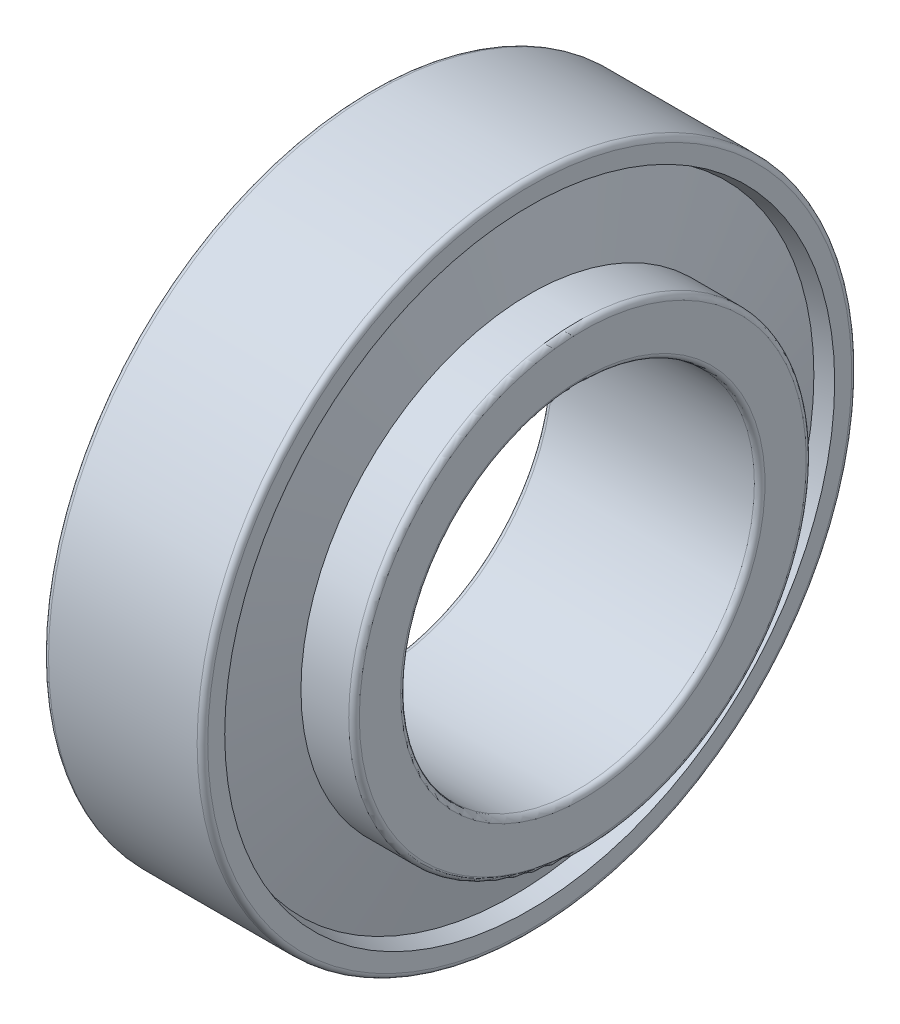
ISO-10303-21;
HEADER;
FILE_DESCRIPTION(('STEP AP214'),'2;1');
FILE_NAME('part.step','',(''),(''),'','','');
FILE_SCHEMA(('AUTOMOTIVE_DESIGN { 1 0 10303 214 1 1 1 1 }'));
ENDSEC;
DATA;
#1=APPLICATION_CONTEXT('core data for automotive mechanical design processes');
#2=APPLICATION_PROTOCOL_DEFINITION('international standard','automotive_design',2000,#1);
#3=PRODUCT_CONTEXT('',#1,'mechanical');
#4=PRODUCT('Part','Part','',(#3));
#5=PRODUCT_RELATED_PRODUCT_CATEGORY('part','',(#4));
#6=PRODUCT_DEFINITION_FORMATION('','',#4);
#7=PRODUCT_DEFINITION_CONTEXT('part definition',#1,'design');
#8=PRODUCT_DEFINITION('design','',#6,#7);
#9=PRODUCT_DEFINITION_SHAPE('','',#8);
#10=(LENGTH_UNIT() NAMED_UNIT(*) SI_UNIT(.MILLI.,.METRE.));
#11=(NAMED_UNIT(*) PLANE_ANGLE_UNIT() SI_UNIT($,.RADIAN.));
#12=(NAMED_UNIT(*) SI_UNIT($,.STERADIAN.) SOLID_ANGLE_UNIT());
#13=UNCERTAINTY_MEASURE_WITH_UNIT(LENGTH_MEASURE(1.E-05),#10,'distance_accuracy_value','');
#14=(GEOMETRIC_REPRESENTATION_CONTEXT(3) GLOBAL_UNCERTAINTY_ASSIGNED_CONTEXT((#13)) GLOBAL_UNIT_ASSIGNED_CONTEXT((#10,
#11,#12)) REPRESENTATION_CONTEXT('',''));
#15=CARTESIAN_POINT('',(0.,0.,0.));
#16=DIRECTION('',(0.,0.,1.));
#17=DIRECTION('',(1.,0.,0.));
#18=AXIS2_PLACEMENT_3D('',#15,#16,#17);
#19=CARTESIAN_POINT('',(0.755685063646205,0.,0.));
#20=DIRECTION('',(-1.,0.,0.));
#21=DIRECTION('',(0.,0.,1.));
#22=AXIS2_PLACEMENT_3D('',#19,#20,#21);
#23=CONICAL_SURFACE('',#22,15.0145140042686,1.36135681655557);
#24=CARTESIAN_POINT('',(1.51137012729241,0.,0.));
#25=DIRECTION('',(-1.,0.,0.));
#26=DIRECTION('',(0.,0.,1.));
#27=AXIS2_PLACEMENT_3D('',#24,#25,#26);
#28=CIRCLE('',#27,11.4592953005556);
#29=CARTESIAN_POINT('',(1.51137012729241,0.,11.4592953005556));
#30=VERTEX_POINT('',#29);
#31=EDGE_CURVE('E112',#30,#30,#28,.T.);
#32=ORIENTED_EDGE('',*,*,#31,.F.);
#33=EDGE_LOOP('',(#32));
#34=FACE_BOUND('',#33,.T.);
#35=CARTESIAN_POINT('',(0.755685063646205,0.,0.));
#36=DIRECTION('',(-1.,0.,0.));
#37=DIRECTION('',(0.,0.,1.));
#38=AXIS2_PLACEMENT_3D('',#35,#36,#37);
#39=CIRCLE('',#38,15.0145140042686);
#40=CARTESIAN_POINT('',(0.755685063646205,0.,15.0145140042686));
#41=VERTEX_POINT('',#40);
#42=EDGE_CURVE('E10',#41,#41,#39,.T.);
#43=ORIENTED_EDGE('',*,*,#42,.T.);
#44=EDGE_LOOP('',(#43));
#45=FACE_BOUND('',#44,.T.);
#46=ADVANCED_FACE('F37',(#34,#45),#23,.F.);
#47=CARTESIAN_POINT('',(0.,0.,0.));
#48=DIRECTION('',(1.,0.,0.));
#49=DIRECTION('',(0.,0.,-1.));
#50=AXIS2_PLACEMENT_3D('',#47,#48,#49);
#51=CONICAL_SURFACE('',#50,14.8105,0.263685978861176);
#52=ORIENTED_EDGE('',*,*,#42,.F.);
#53=EDGE_LOOP('',(#52));
#54=FACE_BOUND('',#53,.T.);
#55=CARTESIAN_POINT('',(0.,0.,0.));
#56=DIRECTION('',(-1.,0.,0.));
#57=DIRECTION('',(0.,0.,1.));
#58=AXIS2_PLACEMENT_3D('',#55,#56,#57);
#59=CIRCLE('',#58,14.8105);
#60=CARTESIAN_POINT('',(0.,0.,14.8105));
#61=VERTEX_POINT('',#60);
#62=EDGE_CURVE('E44',#61,#61,#59,.T.);
#63=ORIENTED_EDGE('',*,*,#62,.T.);
#64=EDGE_LOOP('',(#63));
#65=FACE_BOUND('',#64,.T.);
#66=ADVANCED_FACE('F120',(#54,#65),#51,.F.);
#67=CARTESIAN_POINT('',(0.,14.8105,0.));
#68=DIRECTION('',(1.,0.,0.));
#69=DIRECTION('',(0.,0.,-1.));
#70=AXIS2_PLACEMENT_3D('',#67,#68,#69);
#71=PLANE('',#70);
#72=ORIENTED_EDGE('',*,*,#62,.F.);
#73=EDGE_LOOP('',(#72));
#74=FACE_BOUND('',#73,.T.);
#75=CARTESIAN_POINT('',(0.,0.,0.));
#76=DIRECTION('',(-1.,0.,0.));
#77=DIRECTION('',(0.,0.,1.));
#78=AXIS2_PLACEMENT_3D('',#75,#76,#77);
#79=CIRCLE('',#78,18.2);
#80=CARTESIAN_POINT('',(0.,0.,18.2));
#81=VERTEX_POINT('',#80);
#82=EDGE_CURVE('E49',#81,#81,#79,.T.);
#83=ORIENTED_EDGE('',*,*,#82,.T.);
#84=EDGE_LOOP('',(#83));
#85=FACE_BOUND('',#84,.T.);
#86=ADVANCED_FACE('F124',(#74,#85),#71,.F.);
#87=CARTESIAN_POINT('',(0.3,0.,0.));
#88=DIRECTION('',(-1.,0.,0.));
#89=DIRECTION('',(0.,0.,1.));
#90=AXIS2_PLACEMENT_3D('',#87,#88,#89);
#91=TOROIDAL_SURFACE('',#90,18.2,0.299999999999997);
#92=ORIENTED_EDGE('',*,*,#82,.F.);
#93=EDGE_LOOP('',(#92));
#94=FACE_BOUND('',#93,.T.);
#95=CARTESIAN_POINT('',(0.299999999999967,0.,0.));
#96=DIRECTION('',(-1.,0.,0.));
#97=DIRECTION('',(0.,0.,1.));
#98=AXIS2_PLACEMENT_3D('',#95,#96,#97);
#99=CIRCLE('',#98,18.5);
#100=CARTESIAN_POINT('',(0.299999999999967,0.,18.5));
#101=VERTEX_POINT('',#100);
#102=EDGE_CURVE('E54',#101,#101,#99,.T.);
#103=ORIENTED_EDGE('',*,*,#102,.T.);
#104=EDGE_LOOP('',(#103));
#105=FACE_BOUND('',#104,.T.);
#106=ADVANCED_FACE('F129',(#94,#105),#91,.T.);
#107=CARTESIAN_POINT('',(-882.527700014444,0.,0.));
#108=DIRECTION('',(-1.,0.,0.));
#109=DIRECTION('',(0.,0.,1.));
#110=AXIS2_PLACEMENT_3D('',#107,#108,#109);
#111=CYLINDRICAL_SURFACE('',#110,18.5);
#112=ORIENTED_EDGE('',*,*,#102,.F.);
#113=EDGE_LOOP('',(#112));
#114=FACE_BOUND('',#113,.T.);
#115=CARTESIAN_POINT('',(8.70000000000004,0.,0.));
#116=DIRECTION('',(-1.,0.,0.));
#117=DIRECTION('',(0.,0.,1.));
#118=AXIS2_PLACEMENT_3D('',#115,#116,#117);
#119=CIRCLE('',#118,18.5);
#120=CARTESIAN_POINT('',(8.70000000000004,0.,18.5));
#121=VERTEX_POINT('',#120);
#122=EDGE_CURVE('E60',#121,#121,#119,.T.);
#123=ORIENTED_EDGE('',*,*,#122,.T.);
#124=EDGE_LOOP('',(#123));
#125=FACE_BOUND('',#124,.T.);
#126=ADVANCED_FACE('F135',(#114,#125),#111,.T.);
#127=CARTESIAN_POINT('',(8.7,0.,0.));
#128=DIRECTION('',(-1.,0.,0.));
#129=DIRECTION('',(0.,0.,1.));
#130=AXIS2_PLACEMENT_3D('',#127,#128,#129);
#131=TOROIDAL_SURFACE('',#130,18.2,0.299999999999998);
#132=ORIENTED_EDGE('',*,*,#122,.F.);
#133=EDGE_LOOP('',(#132));
#134=FACE_BOUND('',#133,.T.);
#135=CARTESIAN_POINT('',(9.00000000000001,0.,0.));
#136=DIRECTION('',(-1.,0.,0.));
#137=DIRECTION('',(0.,0.,1.));
#138=AXIS2_PLACEMENT_3D('',#135,#136,#137);
#139=CIRCLE('',#138,18.2);
#140=CARTESIAN_POINT('',(9.00000000000001,0.,18.2));
#141=VERTEX_POINT('',#140);
#142=EDGE_CURVE('E64',#141,#141,#139,.T.);
#143=ORIENTED_EDGE('',*,*,#142,.T.);
#144=EDGE_LOOP('',(#143));
#145=FACE_BOUND('',#144,.T.);
#146=ADVANCED_FACE('F139',(#134,#145),#131,.T.);
#147=CARTESIAN_POINT('',(9.,18.2,0.));
#148=DIRECTION('',(-1.,0.,0.));
#149=DIRECTION('',(0.,0.,1.));
#150=AXIS2_PLACEMENT_3D('',#147,#148,#149);
#151=PLANE('',#150);
#152=ORIENTED_EDGE('',*,*,#142,.F.);
#153=EDGE_LOOP('',(#152));
#154=FACE_BOUND('',#153,.T.);
#155=CARTESIAN_POINT('',(9.00000000000001,0.,0.));
#156=DIRECTION('',(-1.,0.,0.));
#157=DIRECTION('',(0.,0.,1.));
#158=AXIS2_PLACEMENT_3D('',#155,#156,#157);
#159=CIRCLE('',#158,17.2402503374732);
#160=CARTESIAN_POINT('',(9.00000000000001,0.,17.2402503374732));
#161=VERTEX_POINT('',#160);
#162=EDGE_CURVE('E68',#161,#161,#159,.T.);
#163=ORIENTED_EDGE('',*,*,#162,.T.);
#164=EDGE_LOOP('',(#163));
#165=FACE_BOUND('',#164,.T.);
#166=ADVANCED_FACE('F143',(#154,#165),#151,.F.);
#167=CARTESIAN_POINT('',(8.07342329573257,0.,0.));
#168=DIRECTION('',(1.,0.,0.));
#169=DIRECTION('',(0.,0.,-1.));
#170=AXIS2_PLACEMENT_3D('',#167,#168,#169);
#171=CONICAL_SURFACE('',#170,16.990100330819,0.263685978861156);
#172=ORIENTED_EDGE('',*,*,#162,.F.);
#173=EDGE_LOOP('',(#172));
#174=FACE_BOUND('',#173,.T.);
#175=CARTESIAN_POINT('',(8.07342329573257,0.,0.));
#176=DIRECTION('',(-1.,0.,0.));
#177=DIRECTION('',(0.,0.,1.));
#178=AXIS2_PLACEMENT_3D('',#175,#176,#177);
#179=CIRCLE('',#178,16.990100330819);
#180=CARTESIAN_POINT('',(8.07342329573257,0.,16.990100330819));
#181=VERTEX_POINT('',#180);
#182=EDGE_CURVE('E72',#181,#181,#179,.T.);
#183=ORIENTED_EDGE('',*,*,#182,.T.);
#184=EDGE_LOOP('',(#183));
#185=FACE_BOUND('',#184,.T.);
#186=ADVANCED_FACE('F147',(#174,#185),#171,.F.);
#187=CARTESIAN_POINT('',(9.00000000000001,0.,0.));
#188=DIRECTION('',(-1.,0.,0.));
#189=DIRECTION('',(0.,0.,1.));
#190=AXIS2_PLACEMENT_3D('',#187,#188,#189);
#191=CONICAL_SURFACE('',#190,12.6308996691811,1.36135681655558);
#192=ORIENTED_EDGE('',*,*,#182,.F.);
#193=EDGE_LOOP('',(#192));
#194=FACE_BOUND('',#193,.T.);
#195=CARTESIAN_POINT('',(9.00000000000001,0.,0.));
#196=DIRECTION('',(-1.,0.,0.));
#197=DIRECTION('',(0.,0.,1.));
#198=AXIS2_PLACEMENT_3D('',#195,#196,#197);
#199=CIRCLE('',#198,12.6308996691811);
#200=CARTESIAN_POINT('',(9.00000000000001,0.,12.6308996691811));
#201=VERTEX_POINT('',#200);
#202=EDGE_CURVE('E76',#201,#201,#199,.T.);
#203=ORIENTED_EDGE('',*,*,#202,.T.);
#204=EDGE_LOOP('',(#203));
#205=FACE_BOUND('',#204,.T.);
#206=ADVANCED_FACE('F151',(#194,#205),#191,.T.);
#207=CARTESIAN_POINT('',(9.,12.9308996691811,0.));
#208=DIRECTION('',(1.,0.,0.));
#209=DIRECTION('',(0.,0.,-1.));
#210=AXIS2_PLACEMENT_3D('',#207,#208,#209);
#211=PLANE('',#210);
#212=ORIENTED_EDGE('',*,*,#202,.F.);
#213=EDGE_LOOP('',(#212));
#214=FACE_BOUND('',#213,.T.);
#215=CARTESIAN_POINT('',(9.00000000000001,0.,0.));
#216=DIRECTION('',(-1.,0.,0.));
#217=DIRECTION('',(0.,0.,1.));
#218=AXIS2_PLACEMENT_3D('',#215,#216,#217);
#219=CIRCLE('',#218,12.9308996691811);
#220=CARTESIAN_POINT('',(9.00000000000001,0.,12.9308996691811));
#221=VERTEX_POINT('',#220);
#222=EDGE_CURVE('E80',#221,#221,#219,.T.);
#223=ORIENTED_EDGE('',*,*,#222,.T.);
#224=EDGE_LOOP('',(#223));
#225=FACE_BOUND('',#224,.T.);
#226=ADVANCED_FACE('F155',(#214,#225),#211,.F.);
#227=CARTESIAN_POINT('',(-882.527700014444,0.,0.));
#228=DIRECTION('',(-1.,0.,0.));
#229=DIRECTION('',(0.,0.,1.));
#230=AXIS2_PLACEMENT_3D('',#227,#228,#229);
#231=CYLINDRICAL_SURFACE('',#230,12.9308996691811);
#232=ORIENTED_EDGE('',*,*,#222,.F.);
#233=EDGE_LOOP('',(#232));
#234=FACE_BOUND('',#233,.T.);
#235=CARTESIAN_POINT('',(11.7,0.,0.));
#236=DIRECTION('',(-1.,0.,0.));
#237=DIRECTION('',(0.,0.,1.));
#238=AXIS2_PLACEMENT_3D('',#235,#236,#237);
#239=CIRCLE('',#238,12.9308996691811);
#240=CARTESIAN_POINT('',(11.7,0.,12.9308996691811));
#241=VERTEX_POINT('',#240);
#242=EDGE_CURVE('E84',#241,#241,#239,.T.);
#243=ORIENTED_EDGE('',*,*,#242,.T.);
#244=EDGE_LOOP('',(#243));
#245=FACE_BOUND('',#244,.T.);
#246=ADVANCED_FACE('F159',(#234,#245),#231,.T.);
#247=CARTESIAN_POINT('',(11.7,0.,0.));
#248=DIRECTION('',(-1.,0.,0.));
#249=DIRECTION('',(0.,0.,1.));
#250=AXIS2_PLACEMENT_3D('',#247,#248,#249);
#251=TOROIDAL_SURFACE('',#250,12.6308996691811,0.299999999999998);
#252=ORIENTED_EDGE('',*,*,#242,.F.);
#253=EDGE_LOOP('',(#252));
#254=FACE_BOUND('',#253,.T.);
#255=CARTESIAN_POINT('',(12.,0.,0.));
#256=DIRECTION('',(-1.,0.,0.));
#257=DIRECTION('',(0.,0.,1.));
#258=AXIS2_PLACEMENT_3D('',#255,#256,#257);
#259=CIRCLE('',#258,12.6308996691811);
#260=CARTESIAN_POINT('',(12.,0.,12.6308996691811));
#261=VERTEX_POINT('',#260);
#262=EDGE_CURVE('E88',#261,#261,#259,.T.);
#263=ORIENTED_EDGE('',*,*,#262,.T.);
#264=EDGE_LOOP('',(#263));
#265=FACE_BOUND('',#264,.T.);
#266=ADVANCED_FACE('F163',(#254,#265),#251,.T.);
#267=CARTESIAN_POINT('',(12.,10.3,0.));
#268=DIRECTION('',(-1.,0.,0.));
#269=DIRECTION('',(0.,0.,1.));
#270=AXIS2_PLACEMENT_3D('',#267,#268,#269);
#271=PLANE('',#270);
#272=ORIENTED_EDGE('',*,*,#262,.F.);
#273=EDGE_LOOP('',(#272));
#274=FACE_BOUND('',#273,.T.);
#275=CARTESIAN_POINT('',(12.,0.,0.));
#276=DIRECTION('',(-1.,0.,0.));
#277=DIRECTION('',(0.,0.,1.));
#278=AXIS2_PLACEMENT_3D('',#275,#276,#277);
#279=CIRCLE('',#278,10.3);
#280=CARTESIAN_POINT('',(12.,0.,10.3));
#281=VERTEX_POINT('',#280);
#282=EDGE_CURVE('E92',#281,#281,#279,.T.);
#283=ORIENTED_EDGE('',*,*,#282,.T.);
#284=EDGE_LOOP('',(#283));
#285=FACE_BOUND('',#284,.T.);
#286=ADVANCED_FACE('F167',(#274,#285),#271,.F.);
#287=CARTESIAN_POINT('',(11.7,0.,0.));
#288=DIRECTION('',(-1.,0.,0.));
#289=DIRECTION('',(0.,0.,1.));
#290=AXIS2_PLACEMENT_3D('',#287,#288,#289);
#291=TOROIDAL_SURFACE('',#290,10.3,0.299999999999998);
#292=ORIENTED_EDGE('',*,*,#282,.F.);
#293=EDGE_LOOP('',(#292));
#294=FACE_BOUND('',#293,.T.);
#295=CARTESIAN_POINT('',(11.7,0.,0.));
#296=DIRECTION('',(-1.,0.,0.));
#297=DIRECTION('',(0.,0.,1.));
#298=AXIS2_PLACEMENT_3D('',#295,#296,#297);
#299=CIRCLE('',#298,10.);
#300=CARTESIAN_POINT('',(11.7,0.,10.));
#301=VERTEX_POINT('',#300);
#302=EDGE_CURVE('E96',#301,#301,#299,.T.);
#303=ORIENTED_EDGE('',*,*,#302,.T.);
#304=EDGE_LOOP('',(#303));
#305=FACE_BOUND('',#304,.T.);
#306=ADVANCED_FACE('F171',(#294,#305),#291,.T.);
#307=CARTESIAN_POINT('',(-882.527700014444,0.,0.));
#308=DIRECTION('',(-1.,0.,0.));
#309=DIRECTION('',(0.,0.,1.));
#310=AXIS2_PLACEMENT_3D('',#307,#308,#309);
#311=CYLINDRICAL_SURFACE('',#310,10.);
#312=ORIENTED_EDGE('',*,*,#302,.F.);
#313=EDGE_LOOP('',(#312));
#314=FACE_BOUND('',#313,.T.);
#315=CARTESIAN_POINT('',(0.299999999999967,0.,0.));
#316=DIRECTION('',(-1.,0.,0.));
#317=DIRECTION('',(0.,0.,1.));
#318=AXIS2_PLACEMENT_3D('',#315,#316,#317);
#319=CIRCLE('',#318,10.);
#320=CARTESIAN_POINT('',(0.299999999999967,0.,10.));
#321=VERTEX_POINT('',#320);
#322=EDGE_CURVE('E100',#321,#321,#319,.T.);
#323=ORIENTED_EDGE('',*,*,#322,.T.);
#324=EDGE_LOOP('',(#323));
#325=FACE_BOUND('',#324,.T.);
#326=ADVANCED_FACE('F175',(#314,#325),#311,.F.);
#327=CARTESIAN_POINT('',(0.3,0.,0.));
#328=DIRECTION('',(-1.,0.,0.));
#329=DIRECTION('',(0.,0.,1.));
#330=AXIS2_PLACEMENT_3D('',#327,#328,#329);
#331=TOROIDAL_SURFACE('',#330,10.3,0.299999999999997);
#332=ORIENTED_EDGE('',*,*,#322,.F.);
#333=EDGE_LOOP('',(#332));
#334=FACE_BOUND('',#333,.T.);
#335=CARTESIAN_POINT('',(0.,0.,0.));
#336=DIRECTION('',(-1.,0.,0.));
#337=DIRECTION('',(0.,0.,1.));
#338=AXIS2_PLACEMENT_3D('',#335,#336,#337);
#339=CIRCLE('',#338,10.3);
#340=CARTESIAN_POINT('',(0.,0.,10.3));
#341=VERTEX_POINT('',#340);
#342=EDGE_CURVE('E104',#341,#341,#339,.T.);
#343=ORIENTED_EDGE('',*,*,#342,.T.);
#344=EDGE_LOOP('',(#343));
#345=FACE_BOUND('',#344,.T.);
#346=ADVANCED_FACE('F179',(#334,#345),#331,.T.);
#347=CARTESIAN_POINT('',(0.,11.4592953005557,0.));
#348=DIRECTION('',(1.,0.,0.));
#349=DIRECTION('',(0.,0.,-1.));
#350=AXIS2_PLACEMENT_3D('',#347,#348,#349);
#351=PLANE('',#350);
#352=ORIENTED_EDGE('',*,*,#342,.F.);
#353=EDGE_LOOP('',(#352));
#354=FACE_BOUND('',#353,.T.);
#355=CARTESIAN_POINT('',(0.,0.,0.));
#356=DIRECTION('',(-1.,0.,0.));
#357=DIRECTION('',(0.,0.,1.));
#358=AXIS2_PLACEMENT_3D('',#355,#356,#357);
#359=CIRCLE('',#358,11.4592953005557);
#360=CARTESIAN_POINT('',(0.,0.,11.4592953005557));
#361=VERTEX_POINT('',#360);
#362=EDGE_CURVE('E108',#361,#361,#359,.T.);
#363=ORIENTED_EDGE('',*,*,#362,.T.);
#364=EDGE_LOOP('',(#363));
#365=FACE_BOUND('',#364,.T.);
#366=ADVANCED_FACE('F183',(#354,#365),#351,.F.);
#367=CARTESIAN_POINT('',(-882.527700014444,0.,0.));
#368=DIRECTION('',(-1.,0.,0.));
#369=DIRECTION('',(0.,0.,1.));
#370=AXIS2_PLACEMENT_3D('',#367,#368,#369);
#371=CYLINDRICAL_SURFACE('',#370,11.4592953005557);
#372=ORIENTED_EDGE('',*,*,#362,.F.);
#373=EDGE_LOOP('',(#372));
#374=FACE_BOUND('',#373,.T.);
#375=ORIENTED_EDGE('',*,*,#31,.T.);
#376=EDGE_LOOP('',(#375));
#377=FACE_BOUND('',#376,.T.);
#378=ADVANCED_FACE('F117',(#374,#377),#371,.T.);
#379=CLOSED_SHELL('',(#46,#66,#86,#106,#126,#146,#166,#186,#206,#226,#246,#266,#286,#306,#326,
#346,#366,#378));
#380=MANIFOLD_SOLID_BREP('B2',#379);
#381=ADVANCED_BREP_SHAPE_REPRESENTATION('',(#18,#380),#14);
#382=SHAPE_DEFINITION_REPRESENTATION(#9,#381);
ENDSEC;
END-ISO-10303-21;
